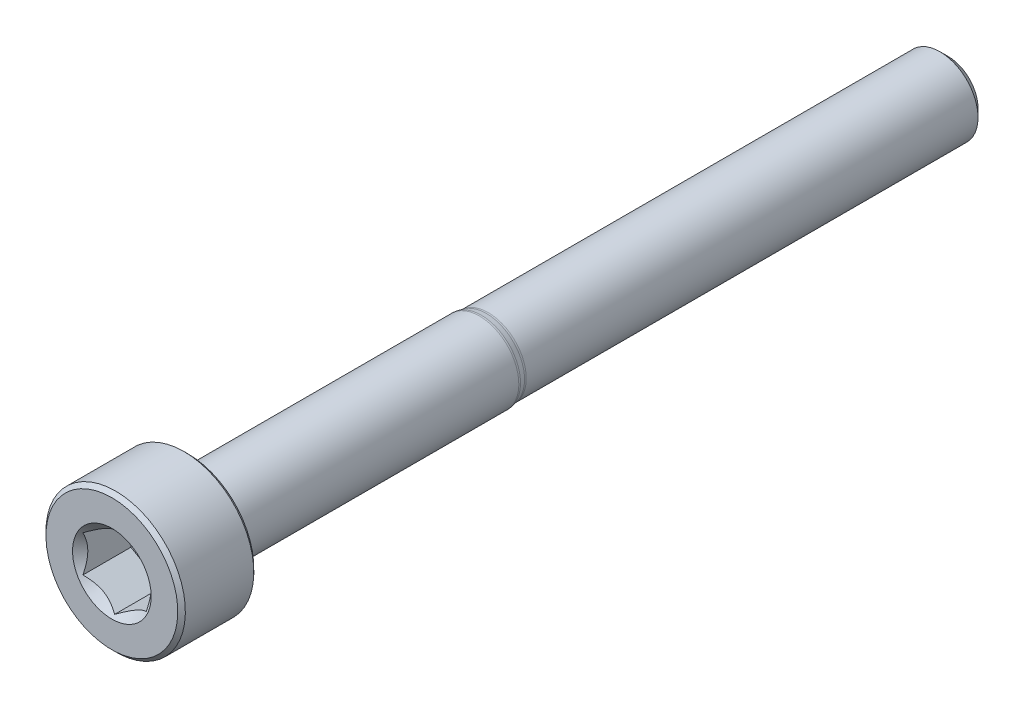
ISO-10303-21;
HEADER;
FILE_DESCRIPTION(('STEP AP214'),'2;1');
FILE_NAME('part.step','',(''),(''),'','','');
FILE_SCHEMA(('AUTOMOTIVE_DESIGN { 1 0 10303 214 1 1 1 1 }'));
ENDSEC;
DATA;
#1=APPLICATION_CONTEXT('core data for automotive mechanical design processes');
#2=APPLICATION_PROTOCOL_DEFINITION('international standard','automotive_design',2000,#1);
#3=PRODUCT_CONTEXT('',#1,'mechanical');
#4=PRODUCT('Part','Part','',(#3));
#5=PRODUCT_RELATED_PRODUCT_CATEGORY('part','',(#4));
#6=PRODUCT_DEFINITION_FORMATION('','',#4);
#7=PRODUCT_DEFINITION_CONTEXT('part definition',#1,'design');
#8=PRODUCT_DEFINITION('design','',#6,#7);
#9=PRODUCT_DEFINITION_SHAPE('','',#8);
#10=(LENGTH_UNIT() NAMED_UNIT(*) SI_UNIT(.MILLI.,.METRE.));
#11=(NAMED_UNIT(*) PLANE_ANGLE_UNIT() SI_UNIT($,.RADIAN.));
#12=(NAMED_UNIT(*) SI_UNIT($,.STERADIAN.) SOLID_ANGLE_UNIT());
#13=UNCERTAINTY_MEASURE_WITH_UNIT(LENGTH_MEASURE(1.E-05),#10,'distance_accuracy_value','');
#14=(GEOMETRIC_REPRESENTATION_CONTEXT(3) GLOBAL_UNCERTAINTY_ASSIGNED_CONTEXT((#13)) GLOBAL_UNIT_ASSIGNED_CONTEXT((#10,
#11,#12)) REPRESENTATION_CONTEXT('',''));
#15=CARTESIAN_POINT('',(0.,0.,0.));
#16=DIRECTION('',(0.,0.,1.));
#17=DIRECTION('',(1.,0.,0.));
#18=AXIS2_PLACEMENT_3D('',#15,#16,#17);
#19=CARTESIAN_POINT('',(0.,1.17524047358083,-16.5));
#20=DIRECTION('',(0.,0.,-1.));
#21=DIRECTION('',(0.,1.,0.));
#22=AXIS2_PLACEMENT_3D('',#19,#20,#21);
#23=PLANE('',#22);
#24=CARTESIAN_POINT('',(0.,0.,-16.5));
#25=DIRECTION('',(0.,0.,-1.));
#26=DIRECTION('',(0.,1.,0.));
#27=AXIS2_PLACEMENT_3D('',#24,#25,#26);
#28=CIRCLE('',#27,1.17524047358083);
#29=CARTESIAN_POINT('',(0.,1.17524047358083,-16.5));
#30=VERTEX_POINT('',#29);
#31=EDGE_CURVE('E48',#30,#30,#28,.T.);
#32=ORIENTED_EDGE('',*,*,#31,.T.);
#33=EDGE_LOOP('',(#32));
#34=FACE_BOUND('',#33,.T.);
#35=ADVANCED_FACE('F35',(#34),#23,.T.);
#36=CARTESIAN_POINT('',(0.,0.,-16.5));
#37=DIRECTION('',(0.,0.,1.));
#38=DIRECTION('',(0.,-1.,0.));
#39=AXIS2_PLACEMENT_3D('',#36,#37,#38);
#40=CONICAL_SURFACE('',#39,1.17524047358083,0.785398163397443);
#41=CARTESIAN_POINT('',(0.,0.,-16.1752404735808));
#42=DIRECTION('',(0.,0.,-1.));
#43=DIRECTION('',(0.,1.,0.));
#44=AXIS2_PLACEMENT_3D('',#41,#42,#43);
#45=CIRCLE('',#44,1.5);
#46=CARTESIAN_POINT('',(0.,1.5,-16.1752404735808));
#47=VERTEX_POINT('',#46);
#48=EDGE_CURVE('E163',#47,#47,#45,.T.);
#49=ORIENTED_EDGE('',*,*,#48,.T.);
#50=EDGE_LOOP('',(#49));
#51=FACE_BOUND('',#50,.T.);
#52=ORIENTED_EDGE('',*,*,#31,.F.);
#53=EDGE_LOOP('',(#52));
#54=FACE_BOUND('',#53,.T.);
#55=ADVANCED_FACE('F169',(#51,#54),#40,.T.);
#56=CARTESIAN_POINT('',(0.,0.,-16.5));
#57=DIRECTION('',(0.,0.,-1.));
#58=DIRECTION('',(0.,1.,0.));
#59=AXIS2_PLACEMENT_3D('',#56,#57,#58);
#60=CYLINDRICAL_SURFACE('',#59,1.5);
#61=CARTESIAN_POINT('',(0.,0.,1.65056572374106));
#62=DIRECTION('',(0.,0.,-1.));
#63=DIRECTION('',(0.,1.,0.));
#64=AXIS2_PLACEMENT_3D('',#61,#62,#63);
#65=CIRCLE('',#64,1.5);
#66=CARTESIAN_POINT('',(0.,1.5,1.65056572374106));
#67=VERTEX_POINT('',#66);
#68=EDGE_CURVE('E160',#67,#67,#65,.T.);
#69=ORIENTED_EDGE('',*,*,#68,.T.);
#70=EDGE_LOOP('',(#69));
#71=FACE_BOUND('',#70,.T.);
#72=ORIENTED_EDGE('',*,*,#48,.F.);
#73=EDGE_LOOP('',(#72));
#74=FACE_BOUND('',#73,.T.);
#75=ADVANCED_FACE('F171',(#71,#74),#60,.T.);
#76=CARTESIAN_POINT('',(0.,0.,1.65056572374106));
#77=DIRECTION('',(0.,0.,-1.));
#78=DIRECTION('',(0.,1.,0.));
#79=AXIS2_PLACEMENT_3D('',#76,#77,#78);
#80=TOROIDAL_SURFACE('',#79,1.875,0.375);
#81=CARTESIAN_POINT('',(0.,0.,1.72372459449711));
#82=DIRECTION('',(0.,0.,-1.));
#83=DIRECTION('',(0.,1.,0.));
#84=AXIS2_PLACEMENT_3D('',#81,#82,#83);
#85=CIRCLE('',#84,1.50720551984879);
#86=CARTESIAN_POINT('',(0.,1.50720551984879,1.72372459449711));
#87=VERTEX_POINT('',#86);
#88=EDGE_CURVE('E157',#87,#87,#85,.T.);
#89=ORIENTED_EDGE('',*,*,#88,.T.);
#90=EDGE_LOOP('',(#89));
#91=FACE_BOUND('',#90,.T.);
#92=ORIENTED_EDGE('',*,*,#68,.F.);
#93=EDGE_LOOP('',(#92));
#94=FACE_BOUND('',#93,.T.);
#95=ADVANCED_FACE('F177',(#91,#94),#80,.F.);
#96=CARTESIAN_POINT('',(0.,0.,1.72372459449711));
#97=DIRECTION('',(0.,0.,1.));
#98=DIRECTION('',(0.,-1.,0.));
#99=AXIS2_PLACEMENT_3D('',#96,#97,#98);
#100=CONICAL_SURFACE('',#99,1.50720551984879,0.196349540849355);
#101=CARTESIAN_POINT('',(0.,0.,1.92338813760475));
#102=DIRECTION('',(0.,0.,-1.));
#103=DIRECTION('',(0.,1.,0.));
#104=AXIS2_PLACEMENT_3D('',#101,#102,#103);
#105=CIRCLE('',#104,1.54692106788774);
#106=CARTESIAN_POINT('',(0.,1.54692106788774,1.92338813760475));
#107=VERTEX_POINT('',#106);
#108=EDGE_CURVE('E154',#107,#107,#105,.T.);
#109=ORIENTED_EDGE('',*,*,#108,.T.);
#110=EDGE_LOOP('',(#109));
#111=FACE_BOUND('',#110,.T.);
#112=ORIENTED_EDGE('',*,*,#88,.F.);
#113=EDGE_LOOP('',(#112));
#114=FACE_BOUND('',#113,.T.);
#115=ADVANCED_FACE('F183',(#111,#114),#100,.T.);
#116=CARTESIAN_POINT('',(0.,0.,1.9965470083608));
#117=DIRECTION('',(0.,0.,-1.));
#118=DIRECTION('',(0.,1.,0.));
#119=AXIS2_PLACEMENT_3D('',#116,#117,#118);
#120=TOROIDAL_SURFACE('',#119,1.17912658773653,0.375);
#121=CARTESIAN_POINT('',(0.,0.,1.9965470083608));
#122=DIRECTION('',(0.,0.,-1.));
#123=DIRECTION('',(0.,1.,0.));
#124=AXIS2_PLACEMENT_3D('',#121,#122,#123);
#125=CIRCLE('',#124,1.55412658773653);
#126=CARTESIAN_POINT('',(0.,1.55412658773653,1.9965470083608));
#127=VERTEX_POINT('',#126);
#128=EDGE_CURVE('E151',#127,#127,#125,.T.);
#129=ORIENTED_EDGE('',*,*,#128,.T.);
#130=EDGE_LOOP('',(#129));
#131=FACE_BOUND('',#130,.T.);
#132=ORIENTED_EDGE('',*,*,#108,.F.);
#133=EDGE_LOOP('',(#132));
#134=FACE_BOUND('',#133,.T.);
#135=ADVANCED_FACE('F187',(#131,#134),#120,.T.);
#136=CARTESIAN_POINT('',(0.,0.,-16.5));
#137=DIRECTION('',(0.,0.,-1.));
#138=DIRECTION('',(0.,1.,0.));
#139=AXIS2_PLACEMENT_3D('',#136,#137,#138);
#140=CYLINDRICAL_SURFACE('',#139,1.55412658773653);
#141=CARTESIAN_POINT('',(0.,0.,13.35));
#142=DIRECTION('',(0.,0.,-1.));
#143=DIRECTION('',(0.,1.,0.));
#144=AXIS2_PLACEMENT_3D('',#141,#142,#143);
#145=CIRCLE('',#144,1.55412658773653);
#146=CARTESIAN_POINT('',(0.,1.55412658773653,13.35));
#147=VERTEX_POINT('',#146);
#148=EDGE_CURVE('E148',#147,#147,#145,.T.);
#149=ORIENTED_EDGE('',*,*,#148,.T.);
#150=EDGE_LOOP('',(#149));
#151=FACE_BOUND('',#150,.T.);
#152=ORIENTED_EDGE('',*,*,#128,.F.);
#153=EDGE_LOOP('',(#152));
#154=FACE_BOUND('',#153,.T.);
#155=ADVANCED_FACE('F191',(#151,#154),#140,.T.);
#156=CARTESIAN_POINT('',(0.,0.,13.35));
#157=DIRECTION('',(0.,0.,-1.));
#158=DIRECTION('',(0.,1.,0.));
#159=AXIS2_PLACEMENT_3D('',#156,#157,#158);
#160=TOROIDAL_SURFACE('',#159,1.70412658773653,0.15);
#161=CARTESIAN_POINT('',(0.,0.,13.5));
#162=DIRECTION('',(0.,0.,-1.));
#163=DIRECTION('',(0.,1.,0.));
#164=AXIS2_PLACEMENT_3D('',#161,#162,#163);
#165=CIRCLE('',#164,1.70412658773653);
#166=CARTESIAN_POINT('',(0.,1.70412658773653,13.5));
#167=VERTEX_POINT('',#166);
#168=EDGE_CURVE('E145',#167,#167,#165,.T.);
#169=ORIENTED_EDGE('',*,*,#168,.T.);
#170=EDGE_LOOP('',(#169));
#171=FACE_BOUND('',#170,.T.);
#172=ORIENTED_EDGE('',*,*,#148,.F.);
#173=EDGE_LOOP('',(#172));
#174=FACE_BOUND('',#173,.T.);
#175=ADVANCED_FACE('F195',(#171,#174),#160,.F.);
#176=CARTESIAN_POINT('',(0.,2.6,13.5));
#177=DIRECTION('',(0.,0.,-1.));
#178=DIRECTION('',(0.,1.,0.));
#179=AXIS2_PLACEMENT_3D('',#176,#177,#178);
#180=PLANE('',#179);
#181=CARTESIAN_POINT('',(0.,0.,13.5));
#182=DIRECTION('',(0.,0.,-1.));
#183=DIRECTION('',(0.,1.,0.));
#184=AXIS2_PLACEMENT_3D('',#181,#182,#183);
#185=CIRCLE('',#184,2.6);
#186=CARTESIAN_POINT('',(0.,2.6,13.5));
#187=VERTEX_POINT('',#186);
#188=EDGE_CURVE('E142',#187,#187,#185,.T.);
#189=ORIENTED_EDGE('',*,*,#188,.T.);
#190=EDGE_LOOP('',(#189));
#191=FACE_BOUND('',#190,.T.);
#192=ORIENTED_EDGE('',*,*,#168,.F.);
#193=EDGE_LOOP('',(#192));
#194=FACE_BOUND('',#193,.T.);
#195=ADVANCED_FACE('F199',(#191,#194),#180,.T.);
#196=CARTESIAN_POINT('',(0.,0.,13.5));
#197=DIRECTION('',(0.,0.,1.));
#198=DIRECTION('',(0.,-1.,0.));
#199=AXIS2_PLACEMENT_3D('',#196,#197,#198);
#200=CONICAL_SURFACE('',#199,2.6,0.785398163397434);
#201=CARTESIAN_POINT('',(0.,0.,13.65));
#202=DIRECTION('',(0.,0.,-1.));
#203=DIRECTION('',(0.,1.,0.));
#204=AXIS2_PLACEMENT_3D('',#201,#202,#203);
#205=CIRCLE('',#204,2.75);
#206=CARTESIAN_POINT('',(0.,2.75,13.65));
#207=VERTEX_POINT('',#206);
#208=EDGE_CURVE('E139',#207,#207,#205,.T.);
#209=ORIENTED_EDGE('',*,*,#208,.T.);
#210=EDGE_LOOP('',(#209));
#211=FACE_BOUND('',#210,.T.);
#212=ORIENTED_EDGE('',*,*,#188,.F.);
#213=EDGE_LOOP('',(#212));
#214=FACE_BOUND('',#213,.T.);
#215=ADVANCED_FACE('F203',(#211,#214),#200,.T.);
#216=CARTESIAN_POINT('',(0.,0.,-16.5));
#217=DIRECTION('',(0.,0.,-1.));
#218=DIRECTION('',(0.,1.,0.));
#219=AXIS2_PLACEMENT_3D('',#216,#217,#218);
#220=CYLINDRICAL_SURFACE('',#219,2.75);
#221=CARTESIAN_POINT('',(0.,0.,16.35));
#222=DIRECTION('',(0.,0.,-1.));
#223=DIRECTION('',(0.,1.,0.));
#224=AXIS2_PLACEMENT_3D('',#221,#222,#223);
#225=CIRCLE('',#224,2.75);
#226=CARTESIAN_POINT('',(0.,2.75,16.35));
#227=VERTEX_POINT('',#226);
#228=EDGE_CURVE('E136',#227,#227,#225,.T.);
#229=ORIENTED_EDGE('',*,*,#228,.T.);
#230=EDGE_LOOP('',(#229));
#231=FACE_BOUND('',#230,.T.);
#232=ORIENTED_EDGE('',*,*,#208,.F.);
#233=EDGE_LOOP('',(#232));
#234=FACE_BOUND('',#233,.T.);
#235=ADVANCED_FACE('F207',(#231,#234),#220,.T.);
#236=CARTESIAN_POINT('',(0.,0.,16.35));
#237=DIRECTION('',(0.,0.,-1.));
#238=DIRECTION('',(0.,1.,0.));
#239=AXIS2_PLACEMENT_3D('',#236,#237,#238);
#240=CONICAL_SURFACE('',#239,2.75,0.785398163397457);
#241=CARTESIAN_POINT('',(0.,0.,16.5));
#242=DIRECTION('',(0.,0.,-1.));
#243=DIRECTION('',(0.,1.,0.));
#244=AXIS2_PLACEMENT_3D('',#241,#242,#243);
#245=CIRCLE('',#244,2.6);
#246=CARTESIAN_POINT('',(0.,2.6,16.5));
#247=VERTEX_POINT('',#246);
#248=EDGE_CURVE('E133',#247,#247,#245,.T.);
#249=ORIENTED_EDGE('',*,*,#248,.T.);
#250=EDGE_LOOP('',(#249));
#251=FACE_BOUND('',#250,.T.);
#252=ORIENTED_EDGE('',*,*,#228,.F.);
#253=EDGE_LOOP('',(#252));
#254=FACE_BOUND('',#253,.T.);
#255=ADVANCED_FACE('F211',(#251,#254),#240,.T.);
#256=CARTESIAN_POINT('',(0.,0.,16.5));
#257=DIRECTION('',(0.,0.,1.));
#258=DIRECTION('',(0.,-1.,0.));
#259=AXIS2_PLACEMENT_3D('',#256,#257,#258);
#260=PLANE('',#259);
#261=CARTESIAN_POINT('',(0.,0.,16.5));
#262=DIRECTION('',(0.,0.,1.));
#263=DIRECTION('',(1.,0.,0.));
#264=AXIS2_PLACEMENT_3D('',#261,#262,#263);
#265=CIRCLE('',#264,1.55162884844711);
#266=CARTESIAN_POINT('',(1.55162884844711,0.,16.5));
#267=VERTEX_POINT('',#266);
#268=EDGE_CURVE('E107',#267,#267,#265,.T.);
#269=ORIENTED_EDGE('',*,*,#268,.F.);
#270=EDGE_LOOP('',(#269));
#271=FACE_BOUND('',#270,.T.);
#272=ORIENTED_EDGE('',*,*,#248,.F.);
#273=EDGE_LOOP('',(#272));
#274=FACE_BOUND('',#273,.T.);
#275=ADVANCED_FACE('F215',(#271,#274),#260,.T.);
#276=CARTESIAN_POINT('',(0.,0.,16.5));
#277=DIRECTION('',(0.,0.,1.));
#278=DIRECTION('',(1.,0.,0.));
#279=AXIS2_PLACEMENT_3D('',#276,#277,#278);
#280=CONICAL_SURFACE('',#279,1.55162884844711,0.78539816339745);
#281=ORIENTED_EDGE('',*,*,#268,.T.);
#282=EDGE_LOOP('',(#281));
#283=FACE_BOUND('',#282,.T.);
#284=CARTESIAN_POINT('',(-0.000199999999997518,-1.4434911430279,16.3918623084361));
#285=CARTESIAN_POINT('',(0.0427751670715894,-1.41867941875065,16.3670684925821));
#286=CARTESIAN_POINT('',(0.0864690047459507,-1.39345276980743,16.3437305589456));
#287=CARTESIAN_POINT('',(0.175565930841944,-1.34201263554194,16.3009988286115));
#288=CARTESIAN_POINT('',(0.220977498357066,-1.31579425481276,16.2816288168874));
#289=CARTESIAN_POINT('',(0.312547820935261,-1.26292610442246,16.2484473079404));
#290=CARTESIAN_POINT('',(0.358683240175887,-1.23628980770471,16.2345523835796));
#291=CARTESIAN_POINT('',(0.451970080407593,-1.18243062538508,16.2131441066876));
#292=CARTESIAN_POINT('',(0.49911864913638,-1.15520938653761,16.2056147660937));
#293=CARTESIAN_POINT('',(0.580373556887252,-1.10829684367467,16.1988213225777));
#294=CARTESIAN_POINT('',(0.61437487662794,-1.08866617256958,16.1978153836313));
#295=CARTESIAN_POINT('',(0.682317764432477,-1.04943932800611,16.1995082394383));
#296=CARTESIAN_POINT('',(0.716259317655657,-1.02984316311599,16.2022078517425));
#297=CARTESIAN_POINT('',(0.783814856457499,-0.990839954603497,16.2111557548433));
#298=CARTESIAN_POINT('',(0.817428507286774,-0.971433104248769,16.2174073504267));
#299=CARTESIAN_POINT('',(0.884094638217812,-0.932943395609903,16.2331225059409));
#300=CARTESIAN_POINT('',(0.917146871030294,-0.913860680098298,16.2425874446144));
#301=CARTESIAN_POINT('',(1.00179969160026,-0.864986351354566,16.2706782152145));
#302=CARTESIAN_POINT('',(1.05286649242964,-0.835502920149074,16.2914169819792));
#303=CARTESIAN_POINT('',(1.15300085411325,-0.777690319475906,16.3381339591984));
#304=CARTESIAN_POINT('',(1.20207431157827,-0.749357745598415,16.3640951204737));
#305=CARTESIAN_POINT('',(1.2502,-0.721572366433192,16.3918623084361));
#306=B_SPLINE_CURVE_WITH_KNOTS('',3,(#284,#285,#286,#287,#288,#289,#290,#291,#292,#293,#294,
#295,#296,#297,#298,#299,#300,#301,#302,#303,#304,#305),.UNSPECIFIED.,.F.,.F.,(4,2,2,2,2,2,2,2,
2,2,4),(0.,0.166533409618304,0.334037607289761,0.498880396489696,0.663307919240271,
0.780963963458823,0.898645970148449,1.01643764860773,1.13427993171549,1.3214865203214,
1.50809158792573),.UNSPECIFIED.);
#307=CARTESIAN_POINT('',(0.,-1.44337567297406,16.3917468245269));
#308=VERTEX_POINT('',#307);
#309=CARTESIAN_POINT('',(1.25,-0.72168783648703,16.391746824527));
#310=VERTEX_POINT('',#309);
#311=EDGE_CURVE('E12',#308,#310,#306,.T.);
#312=ORIENTED_EDGE('',*,*,#311,.F.);
#313=CARTESIAN_POINT('',(-1.25019999999999,-0.721572366433192,16.3918623084361));
#314=CARTESIAN_POINT('',(-1.20722483292841,-0.746384090710441,16.367068492582));
#315=CARTESIAN_POINT('',(-1.16353099525405,-0.771610739653661,16.3437305589456));
#316=CARTESIAN_POINT('',(-1.07443406915805,-0.823050873919151,16.3009988286115));
#317=CARTESIAN_POINT('',(-1.02902250164293,-0.849269254648329,16.2816288168874));
#318=CARTESIAN_POINT('',(-0.937452179064737,-0.902137405038632,16.2484473079404));
#319=CARTESIAN_POINT('',(-0.891316759824111,-0.928773701756384,16.2345523835796));
#320=CARTESIAN_POINT('',(-0.798029919592404,-0.982632884076009,16.2131441066876));
#321=CARTESIAN_POINT('',(-0.750881350863616,-1.00985412292348,16.2056147660937));
#322=CARTESIAN_POINT('',(-0.669626443112744,-1.05676666578642,16.1988213225777));
#323=CARTESIAN_POINT('',(-0.635625123372056,-1.07639733689151,16.1978153836313));
#324=CARTESIAN_POINT('',(-0.567682235567519,-1.11562418145498,16.1995082394383));
#325=CARTESIAN_POINT('',(-0.53374068234434,-1.1352203463451,16.2022078517425));
#326=CARTESIAN_POINT('',(-0.466185143542498,-1.17422355485759,16.2111557548433));
#327=CARTESIAN_POINT('',(-0.432571492713223,-1.19363040521232,16.2174073504267));
#328=CARTESIAN_POINT('',(-0.365905361782185,-1.23212011385119,16.2331225059409));
#329=CARTESIAN_POINT('',(-0.332853128969702,-1.25120282936279,16.2425874446144));
#330=CARTESIAN_POINT('',(-0.248200308399733,-1.30007715810652,16.2706782152145));
#331=CARTESIAN_POINT('',(-0.19713350757036,-1.32956058931202,16.2914169819791));
#332=CARTESIAN_POINT('',(-0.096999145886743,-1.38737318998518,16.3381339591984));
#333=CARTESIAN_POINT('',(-0.0479256884217282,-1.41570576386268,16.3640951204737));
#334=CARTESIAN_POINT('',(0.000200000000003181,-1.4434911430279,16.3918623084361));
#335=B_SPLINE_CURVE_WITH_KNOTS('',3,(#313,#314,#315,#316,#317,#318,#319,#320,#321,#322,#323,
#324,#325,#326,#327,#328,#329,#330,#331,#332,#333,#334),.UNSPECIFIED.,.F.,.F.,(4,2,2,2,2,2,2,2,
2,2,4),(0.,0.166533409618302,0.334037607289759,0.498880396489696,0.663307919240272,
0.780963963458824,0.89864597014845,1.01643764860773,1.13427993171549,1.3214865203214,
1.50809158792573),.UNSPECIFIED.);
#336=CARTESIAN_POINT('',(-1.24999999999999,-0.72168783648703,16.3917468245269));
#337=VERTEX_POINT('',#336);
#338=EDGE_CURVE('E93',#337,#308,#335,.T.);
#339=ORIENTED_EDGE('',*,*,#338,.F.);
#340=CARTESIAN_POINT('',(-1.24999999999999,-1.52022146239344,16.9165107031908));
#341=CARTESIAN_POINT('',(-1.24999999999999,-1.48354689134961,16.8881868971872));
#342=CARTESIAN_POINT('',(-1.24999999999999,-1.44667707589304,16.8601167209305));
#343=CARTESIAN_POINT('',(-1.24999999999999,-1.37246477804769,16.8045906550178));
#344=CARTESIAN_POINT('',(-1.24999999999999,-1.33512218721452,16.7771349104479));
#345=CARTESIAN_POINT('',(-1.24999999999999,-1.22171630832113,16.6954580977105));
#346=CARTESIAN_POINT('',(-1.24999999999999,-1.14482995781091,16.6423614251193));
#347=CARTESIAN_POINT('',(-1.24999999999999,-0.983056768942581,16.5373497341694));
#348=CARTESIAN_POINT('',(-1.25,-0.897974111811051,16.4857332692583));
#349=CARTESIAN_POINT('',(-1.25,-0.723462355215551,16.3907835510851));
#350=CARTESIAN_POINT('',(-1.24999999999999,-0.634049271919702,16.3474223218592));
#351=CARTESIAN_POINT('',(-1.25,-0.500588771143697,16.2943517704072));
#352=CARTESIAN_POINT('',(-1.25,-0.458691726208108,16.2792650132717));
#353=CARTESIAN_POINT('',(-1.25,-0.373815329706777,16.2524474977027));
#354=CARTESIAN_POINT('',(-1.25,-0.330835910419722,16.2407169498287));
#355=CARTESIAN_POINT('',(-1.25,-0.244810833071147,16.221443133046));
#356=CARTESIAN_POINT('',(-1.25,-0.201782707467569,16.2138228916945));
#357=CARTESIAN_POINT('',(-1.25,-0.115176247984994,16.2029319070796));
#358=CARTESIAN_POINT('',(-1.25,-0.0715980347745588,16.1996602260857));
#359=CARTESIAN_POINT('',(-1.25,0.0136806197531971,16.1977521004587));
#360=CARTESIAN_POINT('',(-1.25,0.0553765370047052,16.198912057167));
#361=CARTESIAN_POINT('',(-1.25,0.13844909645316,16.2053326638846));
#362=CARTESIAN_POINT('',(-1.25,0.179825709781942,16.2105936803828));
#363=CARTESIAN_POINT('',(-1.25,0.262662840763598,16.2250057472122));
#364=CARTESIAN_POINT('',(-1.25,0.30411112066965,16.2342260073002));
#365=CARTESIAN_POINT('',(-1.25,0.386089884230833,16.2560423562394));
#366=CARTESIAN_POINT('',(-1.25,0.426620414510367,16.2686382731779));
#367=CARTESIAN_POINT('',(-1.25,0.550794781768361,16.3120595916479));
#368=CARTESIAN_POINT('',(-1.25,0.632755591043411,16.3476828270097));
#369=CARTESIAN_POINT('',(-1.25,0.792852508946382,16.4269681445595));
#370=CARTESIAN_POINT('',(-1.25,0.870973935410875,16.4706584421105));
#371=CARTESIAN_POINT('',(-1.25,1.02031328199646,16.5608815878762));
#372=CARTESIAN_POINT('',(-1.25,1.09168171050215,16.6071684587952));
#373=CARTESIAN_POINT('',(-1.25,1.19682802849917,16.6787614995367));
#374=CARTESIAN_POINT('',(-1.25,1.2314248214359,16.7028858278753));
#375=CARTESIAN_POINT('',(-1.25,1.30014350643268,16.7517825841031));
#376=CARTESIAN_POINT('',(-1.25,1.33426552680451,16.7765548314612));
#377=CARTESIAN_POINT('',(-1.25,1.36818950249276,16.8015960474388));
#378=B_SPLINE_CURVE_WITH_KNOTS('',3,(#340,#341,#342,#343,#344,#345,#346,#347,#348,#349,#350,
#351,#352,#353,#354,#355,#356,#357,#358,#359,#360,#361,#362,#363,#364,#365,#366,#367,#368,#369,
#370,#371,#372,#373,#374,#375,#376,#377),.UNSPECIFIED.,.F.,.F.,(4,2,2,2,2,2,2,2,2,2,2,2,2,2,2,2,
2,2,4),(0.,0.139012369615042,0.278057225136916,0.558259504053766,0.856585057342469,
1.15388088887298,1.28736138903991,1.42085026158166,1.55174393609412,1.68260937990423,
1.80753647715251,1.93247473971974,2.05969207441602,2.18690293152763,2.45422704655831,
2.72250450232038,2.97756898823761,3.10409578574713,3.23058769667825),.UNSPECIFIED.);
#379=CARTESIAN_POINT('',(-1.25,0.72168783648703,16.3917468245269));
#380=VERTEX_POINT('',#379);
#381=EDGE_CURVE('E106',#380,#337,#378,.F.);
#382=ORIENTED_EDGE('',*,*,#381,.F.);
#383=CARTESIAN_POINT('',(0.000200000000001893,1.4434911430279,16.3918623084361));
#384=CARTESIAN_POINT('',(-0.042775167071584,1.41867941875065,16.3670684925821));
#385=CARTESIAN_POINT('',(-0.0864690047459446,1.39345276980743,16.3437305589456));
#386=CARTESIAN_POINT('',(-0.175565930841938,1.34201263554194,16.3009988286115));
#387=CARTESIAN_POINT('',(-0.22097749835706,1.31579425481276,16.2816288168874));
#388=CARTESIAN_POINT('',(-0.312547820935256,1.26292610442246,16.2484473079404));
#389=CARTESIAN_POINT('',(-0.358683240175881,1.23628980770471,16.2345523835796));
#390=CARTESIAN_POINT('',(-0.451970080407587,1.18243062538508,16.2131441066876));
#391=CARTESIAN_POINT('',(-0.499118649136374,1.15520938653761,16.2056147660937));
#392=CARTESIAN_POINT('',(-0.580373556887247,1.10829684367467,16.1988213225777));
#393=CARTESIAN_POINT('',(-0.614374876627935,1.08866617256958,16.1978153836313));
#394=CARTESIAN_POINT('',(-0.682317764432471,1.04943932800611,16.1995082394383));
#395=CARTESIAN_POINT('',(-0.716259317655651,1.02984316311599,16.2022078517425));
#396=CARTESIAN_POINT('',(-0.783814856457493,0.990839954603498,16.2111557548433));
#397=CARTESIAN_POINT('',(-0.817428507286768,0.97143310424877,16.2174073504267));
#398=CARTESIAN_POINT('',(-0.884094638217806,0.932943395609904,16.2331225059409));
#399=CARTESIAN_POINT('',(-0.917146871030288,0.913860680098299,16.2425874446144));
#400=CARTESIAN_POINT('',(-1.00179969160026,0.864986351354566,16.2706782152145));
#401=CARTESIAN_POINT('',(-1.05286649242963,0.835502920149074,16.2914169819791));
#402=CARTESIAN_POINT('',(-1.15300085411325,0.777690319475906,16.3381339591984));
#403=CARTESIAN_POINT('',(-1.20207431157826,0.749357745598414,16.3640951204737));
#404=CARTESIAN_POINT('',(-1.25019999999999,0.721572366433192,16.3918623084361));
#405=B_SPLINE_CURVE_WITH_KNOTS('',3,(#383,#384,#385,#386,#387,#388,#389,#390,#391,#392,#393,
#394,#395,#396,#397,#398,#399,#400,#401,#402,#403,#404),.UNSPECIFIED.,.F.,.F.,(4,2,2,2,2,2,2,2,
2,2,4),(0.,0.166533409618301,0.33403760728976,0.498880396489695,0.663307919240271,
0.780963963458823,0.898645970148449,1.01643764860773,1.13427993171549,1.3214865203214,
1.50809158792573),.UNSPECIFIED.);
#406=CARTESIAN_POINT('',(0.,1.44337567297406,16.3917468245269));
#407=VERTEX_POINT('',#406);
#408=EDGE_CURVE('E265',#407,#380,#405,.T.);
#409=ORIENTED_EDGE('',*,*,#408,.F.);
#410=CARTESIAN_POINT('',(1.2502,0.721572366433192,16.3918623084361));
#411=CARTESIAN_POINT('',(1.20722483292841,0.746384090710442,16.3670684925821));
#412=CARTESIAN_POINT('',(1.16353099525405,0.771610739653662,16.3437305589456));
#413=CARTESIAN_POINT('',(1.07443406915806,0.823050873919152,16.3009988286115));
#414=CARTESIAN_POINT('',(1.02902250164294,0.84926925464833,16.2816288168874));
#415=CARTESIAN_POINT('',(0.937452179064742,0.902137405038632,16.2484473079404));
#416=CARTESIAN_POINT('',(0.891316759824116,0.928773701756384,16.2345523835796));
#417=CARTESIAN_POINT('',(0.798029919592408,0.98263288407601,16.2131441066876));
#418=CARTESIAN_POINT('',(0.75088135086362,1.00985412292348,16.2056147660937));
#419=CARTESIAN_POINT('',(0.669626443112747,1.05676666578643,16.1988213225777));
#420=CARTESIAN_POINT('',(0.635625123372058,1.07639733689151,16.1978153836313));
#421=CARTESIAN_POINT('',(0.567682235567522,1.11562418145498,16.1995082394383));
#422=CARTESIAN_POINT('',(0.533740682344341,1.1352203463451,16.2022078517425));
#423=CARTESIAN_POINT('',(0.4661851435425,1.17422355485759,16.2111557548433));
#424=CARTESIAN_POINT('',(0.432571492713225,1.19363040521232,16.2174073504267));
#425=CARTESIAN_POINT('',(0.365905361782187,1.23212011385119,16.2331225059409));
#426=CARTESIAN_POINT('',(0.332853128969704,1.25120282936279,16.2425874446144));
#427=CARTESIAN_POINT('',(0.248200308399735,1.30007715810653,16.2706782152145));
#428=CARTESIAN_POINT('',(0.197133507570362,1.32956058931202,16.2914169819792));
#429=CARTESIAN_POINT('',(0.0969991458867457,1.38737318998518,16.3381339591984));
#430=CARTESIAN_POINT('',(0.0479256884217314,1.41570576386268,16.3640951204737));
#431=CARTESIAN_POINT('',(-0.000199999999998779,1.4434911430279,16.3918623084361));
#432=B_SPLINE_CURVE_WITH_KNOTS('',3,(#410,#411,#412,#413,#414,#415,#416,#417,#418,#419,#420,
#421,#422,#423,#424,#425,#426,#427,#428,#429,#430,#431),.UNSPECIFIED.,.F.,.F.,(4,2,2,2,2,2,2,2,
2,2,4),(0.,0.166533409618303,0.334037607289761,0.498880396489698,0.663307919240276,
0.780963963458829,0.898645970148455,1.01643764860773,1.1342799317155,1.32148652032141,
1.50809158792573),.UNSPECIFIED.);
#433=CARTESIAN_POINT('',(1.25,0.72168783648703,16.391746824527));
#434=VERTEX_POINT('',#433);
#435=EDGE_CURVE('E238',#434,#407,#432,.T.);
#436=ORIENTED_EDGE('',*,*,#435,.F.);
#437=CARTESIAN_POINT('',(1.25,-1.52022146239344,16.9165107031908));
#438=CARTESIAN_POINT('',(1.25,-1.48354689134961,16.8881868971872));
#439=CARTESIAN_POINT('',(1.25,-1.44667707589304,16.8601167209305));
#440=CARTESIAN_POINT('',(1.25,-1.37246477804768,16.8045906550178));
#441=CARTESIAN_POINT('',(1.25,-1.33512218721451,16.7771349104479));
#442=CARTESIAN_POINT('',(1.25,-1.22171630832113,16.6954580977105));
#443=CARTESIAN_POINT('',(1.25,-1.14482995781091,16.6423614251193));
#444=CARTESIAN_POINT('',(1.25,-0.983056768942579,16.5373497341694));
#445=CARTESIAN_POINT('',(1.25,-0.89797411181105,16.4857332692583));
#446=CARTESIAN_POINT('',(1.25,-0.723462355215551,16.3907835510851));
#447=CARTESIAN_POINT('',(1.25,-0.634049271919702,16.3474223218592));
#448=CARTESIAN_POINT('',(1.25,-0.500588771143696,16.2943517704072));
#449=CARTESIAN_POINT('',(1.25,-0.458691726208107,16.2792650132717));
#450=CARTESIAN_POINT('',(1.25,-0.373815329706776,16.2524474977027));
#451=CARTESIAN_POINT('',(1.25,-0.330835910419721,16.2407169498287));
#452=CARTESIAN_POINT('',(1.25,-0.244810833071146,16.221443133046));
#453=CARTESIAN_POINT('',(1.25,-0.201782707467568,16.2138228916945));
#454=CARTESIAN_POINT('',(1.25,-0.115176247984993,16.2029319070796));
#455=CARTESIAN_POINT('',(1.25,-0.0715980347745582,16.1996602260857));
#456=CARTESIAN_POINT('',(1.25,0.0136806197531977,16.1977521004587));
#457=CARTESIAN_POINT('',(1.25,0.0553765370047058,16.198912057167));
#458=CARTESIAN_POINT('',(1.25,0.138449096453161,16.2053326638846));
#459=CARTESIAN_POINT('',(1.25,0.179825709781943,16.2105936803828));
#460=CARTESIAN_POINT('',(1.25,0.262662840763599,16.2250057472122));
#461=CARTESIAN_POINT('',(1.25,0.304111120669651,16.2342260073002));
#462=CARTESIAN_POINT('',(1.25,0.386089884230834,16.2560423562394));
#463=CARTESIAN_POINT('',(1.25,0.426620414510369,16.2686382731779));
#464=CARTESIAN_POINT('',(1.25,0.550794781768362,16.3120595916479));
#465=CARTESIAN_POINT('',(1.25,0.632755591043411,16.3476828270097));
#466=CARTESIAN_POINT('',(1.25,0.792852508946382,16.4269681445595));
#467=CARTESIAN_POINT('',(1.25,0.870973935410876,16.4706584421105));
#468=CARTESIAN_POINT('',(1.25,1.02031328199646,16.5608815878762));
#469=CARTESIAN_POINT('',(1.25,1.09168171050215,16.6071684587952));
#470=CARTESIAN_POINT('',(1.25,1.19682802849918,16.6787614995367));
#471=CARTESIAN_POINT('',(1.25,1.2314248214359,16.7028858278753));
#472=CARTESIAN_POINT('',(1.25,1.30014350643268,16.7517825841031));
#473=CARTESIAN_POINT('',(1.25,1.33426552680452,16.7765548314612));
#474=CARTESIAN_POINT('',(1.25,1.36818950249276,16.8015960474388));
#475=B_SPLINE_CURVE_WITH_KNOTS('',3,(#437,#438,#439,#440,#441,#442,#443,#444,#445,#446,#447,
#448,#449,#450,#451,#452,#453,#454,#455,#456,#457,#458,#459,#460,#461,#462,#463,#464,#465,#466,
#467,#468,#469,#470,#471,#472,#473,#474),.UNSPECIFIED.,.F.,.F.,(4,2,2,2,2,2,2,2,2,2,2,2,2,2,2,2,
2,2,4),(0.,0.139012369615043,0.278057225136917,0.558259504053767,0.856585057342466,
1.15388088887297,1.2873613890399,1.42085026158166,1.55174393609412,1.68260937990423,
1.8075364771525,1.93247473971974,2.05969207441601,2.18690293152763,2.45422704655831,
2.72250450232037,2.97756898823761,3.10409578574713,3.23058769667826),.UNSPECIFIED.);
#476=EDGE_CURVE('E55',#310,#434,#475,.T.);
#477=ORIENTED_EDGE('',*,*,#476,.F.);
#478=EDGE_LOOP('',(#312,#339,#382,#409,#436,#477));
#479=FACE_BOUND('',#478,.T.);
#480=ADVANCED_FACE('F92',(#283,#479),#280,.F.);
#481=CARTESIAN_POINT('',(0.,2.6,14.5));
#482=DIRECTION('',(0.,0.,-1.));
#483=DIRECTION('',(0.,1.,0.));
#484=AXIS2_PLACEMENT_3D('',#481,#482,#483);
#485=PLANE('',#484);
#486=DIRECTION('',(0.866025403784439,0.5,0.));
#487=VECTOR('',#486,1.);
#488=CARTESIAN_POINT('',(0.,-1.44337567297406,14.5));
#489=LINE('',#488,#487);
#490=CARTESIAN_POINT('',(0.,-1.44337567297406,14.5));
#491=VERTEX_POINT('',#490);
#492=CARTESIAN_POINT('',(1.25,-0.72168783648703,14.5));
#493=VERTEX_POINT('',#492);
#494=EDGE_CURVE('E110',#491,#493,#489,.T.);
#495=ORIENTED_EDGE('',*,*,#494,.T.);
#496=DIRECTION('',(0.,1.,0.));
#497=VECTOR('',#496,1.);
#498=CARTESIAN_POINT('',(1.25,-0.72168783648703,14.5));
#499=LINE('',#498,#497);
#500=CARTESIAN_POINT('',(1.25,0.72168783648703,14.5));
#501=VERTEX_POINT('',#500);
#502=EDGE_CURVE('E62',#493,#501,#499,.T.);
#503=ORIENTED_EDGE('',*,*,#502,.T.);
#504=DIRECTION('',(-0.866025403784439,0.499999999999999,0.));
#505=VECTOR('',#504,1.);
#506=CARTESIAN_POINT('',(1.25,0.72168783648703,14.5));
#507=LINE('',#506,#505);
#508=CARTESIAN_POINT('',(0.,1.44337567297406,14.5));
#509=VERTEX_POINT('',#508);
#510=EDGE_CURVE('E118',#501,#509,#507,.T.);
#511=ORIENTED_EDGE('',*,*,#510,.T.);
#512=DIRECTION('',(-0.866025403784439,-0.5,0.));
#513=VECTOR('',#512,1.);
#514=CARTESIAN_POINT('',(0.,1.44337567297406,14.5));
#515=LINE('',#514,#513);
#516=CARTESIAN_POINT('',(-1.25,0.721687836487029,14.5));
#517=VERTEX_POINT('',#516);
#518=EDGE_CURVE('E125',#509,#517,#515,.T.);
#519=ORIENTED_EDGE('',*,*,#518,.T.);
#520=DIRECTION('',(0.,-1.,0.));
#521=VECTOR('',#520,1.);
#522=CARTESIAN_POINT('',(-1.25,0.721687836487029,14.5));
#523=LINE('',#522,#521);
#524=CARTESIAN_POINT('',(-1.25,-0.721687836487029,14.5));
#525=VERTEX_POINT('',#524);
#526=EDGE_CURVE('E121',#517,#525,#523,.T.);
#527=ORIENTED_EDGE('',*,*,#526,.T.);
#528=DIRECTION('',(0.866025403784439,-0.5,0.));
#529=VECTOR('',#528,1.);
#530=CARTESIAN_POINT('',(-1.25,-0.721687836487029,14.5));
#531=LINE('',#530,#529);
#532=EDGE_CURVE('E111',#525,#491,#531,.T.);
#533=ORIENTED_EDGE('',*,*,#532,.T.);
#534=EDGE_LOOP('',(#495,#503,#511,#519,#527,#533));
#535=FACE_BOUND('',#534,.T.);
#536=ADVANCED_FACE('F220',(#535),#485,.F.);
#537=CARTESIAN_POINT('',(0.,-1.44337567297406,9.68118692087014));
#538=DIRECTION('',(0.5,-0.866025403784438,0.));
#539=DIRECTION('',(0.866025403784439,0.5,0.));
#540=AXIS2_PLACEMENT_3D('',#537,#538,#539);
#541=PLANE('',#540);
#542=DIRECTION('',(0.,0.,1.));
#543=VECTOR('',#542,1.);
#544=CARTESIAN_POINT('',(0.,-1.44337567297406,9.68118692087014));
#545=LINE('',#544,#543);
#546=EDGE_CURVE('E102',#491,#308,#545,.T.);
#547=ORIENTED_EDGE('',*,*,#546,.T.);
#548=ORIENTED_EDGE('',*,*,#311,.T.);
#549=DIRECTION('',(0.,0.,1.));
#550=VECTOR('',#549,1.);
#551=CARTESIAN_POINT('',(1.25,-0.72168783648703,9.68118692087014));
#552=LINE('',#551,#550);
#553=EDGE_CURVE('E113',#493,#310,#552,.T.);
#554=ORIENTED_EDGE('',*,*,#553,.F.);
#555=ORIENTED_EDGE('',*,*,#494,.F.);
#556=EDGE_LOOP('',(#547,#548,#554,#555));
#557=FACE_BOUND('',#556,.T.);
#558=ADVANCED_FACE('F109',(#557),#541,.F.);
#559=CARTESIAN_POINT('',(-1.25,-0.721687836487029,9.68118692087014));
#560=DIRECTION('',(-0.5,-0.866025403784439,0.));
#561=DIRECTION('',(0.866025403784439,-0.5,0.));
#562=AXIS2_PLACEMENT_3D('',#559,#560,#561);
#563=PLANE('',#562);
#564=DIRECTION('',(0.,0.,1.));
#565=VECTOR('',#564,1.);
#566=CARTESIAN_POINT('',(-1.25,-0.721687836487029,9.68118692087014));
#567=LINE('',#566,#565);
#568=EDGE_CURVE('E105',#525,#337,#567,.T.);
#569=ORIENTED_EDGE('',*,*,#568,.T.);
#570=ORIENTED_EDGE('',*,*,#338,.T.);
#571=ORIENTED_EDGE('',*,*,#546,.F.);
#572=ORIENTED_EDGE('',*,*,#532,.F.);
#573=EDGE_LOOP('',(#569,#570,#571,#572));
#574=FACE_BOUND('',#573,.T.);
#575=ADVANCED_FACE('F101',(#574),#563,.F.);
#576=CARTESIAN_POINT('',(-1.25,0.721687836487029,9.68118692087014));
#577=DIRECTION('',(-1.,0.,0.));
#578=DIRECTION('',(0.,-1.,0.));
#579=AXIS2_PLACEMENT_3D('',#576,#577,#578);
#580=PLANE('',#579);
#581=DIRECTION('',(0.,0.,1.));
#582=VECTOR('',#581,1.);
#583=CARTESIAN_POINT('',(-1.25,0.721687836487029,9.68118692087014));
#584=LINE('',#583,#582);
#585=EDGE_CURVE('E122',#517,#380,#584,.T.);
#586=ORIENTED_EDGE('',*,*,#585,.T.);
#587=ORIENTED_EDGE('',*,*,#381,.T.);
#588=ORIENTED_EDGE('',*,*,#568,.F.);
#589=ORIENTED_EDGE('',*,*,#526,.F.);
#590=EDGE_LOOP('',(#586,#587,#588,#589));
#591=FACE_BOUND('',#590,.T.);
#592=ADVANCED_FACE('F274',(#591),#580,.F.);
#593=CARTESIAN_POINT('',(0.,1.44337567297406,9.68118692087014));
#594=DIRECTION('',(-0.5,0.866025403784439,0.));
#595=DIRECTION('',(-0.866025403784439,-0.5,0.));
#596=AXIS2_PLACEMENT_3D('',#593,#594,#595);
#597=PLANE('',#596);
#598=DIRECTION('',(0.,0.,1.));
#599=VECTOR('',#598,1.);
#600=CARTESIAN_POINT('',(0.,1.44337567297406,9.68118692087014));
#601=LINE('',#600,#599);
#602=EDGE_CURVE('E126',#509,#407,#601,.T.);
#603=ORIENTED_EDGE('',*,*,#602,.T.);
#604=ORIENTED_EDGE('',*,*,#408,.T.);
#605=ORIENTED_EDGE('',*,*,#585,.F.);
#606=ORIENTED_EDGE('',*,*,#518,.F.);
#607=EDGE_LOOP('',(#603,#604,#605,#606));
#608=FACE_BOUND('',#607,.T.);
#609=ADVANCED_FACE('F271',(#608),#597,.F.);
#610=CARTESIAN_POINT('',(1.25,0.72168783648703,9.68118692087014));
#611=DIRECTION('',(0.499999999999999,0.866025403784439,0.));
#612=DIRECTION('',(-0.866025403784439,0.499999999999999,0.));
#613=AXIS2_PLACEMENT_3D('',#610,#611,#612);
#614=PLANE('',#613);
#615=DIRECTION('',(0.,0.,1.));
#616=VECTOR('',#615,1.);
#617=CARTESIAN_POINT('',(1.25,0.72168783648703,9.68118692087014));
#618=LINE('',#617,#616);
#619=EDGE_CURVE('E129',#501,#434,#618,.T.);
#620=ORIENTED_EDGE('',*,*,#619,.T.);
#621=ORIENTED_EDGE('',*,*,#435,.T.);
#622=ORIENTED_EDGE('',*,*,#602,.F.);
#623=ORIENTED_EDGE('',*,*,#510,.F.);
#624=EDGE_LOOP('',(#620,#621,#622,#623));
#625=FACE_BOUND('',#624,.T.);
#626=ADVANCED_FACE('F228',(#625),#614,.F.);
#627=CARTESIAN_POINT('',(1.25,-0.72168783648703,9.68118692087014));
#628=DIRECTION('',(1.,0.,0.));
#629=DIRECTION('',(0.,1.,0.));
#630=AXIS2_PLACEMENT_3D('',#627,#628,#629);
#631=PLANE('',#630);
#632=ORIENTED_EDGE('',*,*,#553,.T.);
#633=ORIENTED_EDGE('',*,*,#476,.T.);
#634=ORIENTED_EDGE('',*,*,#619,.F.);
#635=ORIENTED_EDGE('',*,*,#502,.F.);
#636=EDGE_LOOP('',(#632,#633,#634,#635));
#637=FACE_BOUND('',#636,.T.);
#638=ADVANCED_FACE('F224',(#637),#631,.F.);
#639=CLOSED_SHELL('',(#35,#55,#75,#95,#115,#135,#155,#175,#195,#215,#235,#255,#275,#480,#536,
#558,#575,#592,#609,#626,#638));
#640=MANIFOLD_SOLID_BREP('B2',#639);
#641=ADVANCED_BREP_SHAPE_REPRESENTATION('',(#18,#640),#14);
#642=SHAPE_DEFINITION_REPRESENTATION(#9,#641);
ENDSEC;
END-ISO-10303-21;
